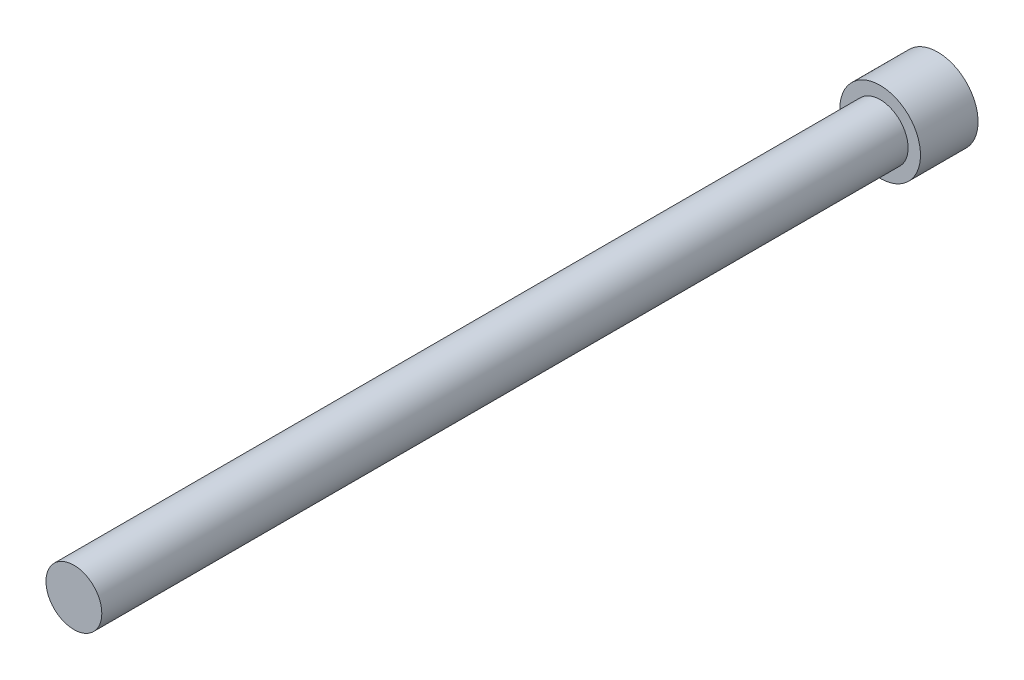
ISO-10303-21;
HEADER;
FILE_DESCRIPTION(('STEP AP214'),'2;1');
FILE_NAME('part.step','',(''),(''),'','','');
FILE_SCHEMA(('AUTOMOTIVE_DESIGN { 1 0 10303 214 1 1 1 1 }'));
ENDSEC;
DATA;
#1=APPLICATION_CONTEXT('core data for automotive mechanical design processes');
#2=APPLICATION_PROTOCOL_DEFINITION('international standard','automotive_design',2000,#1);
#3=PRODUCT_CONTEXT('',#1,'mechanical');
#4=PRODUCT('Part','Part','',(#3));
#5=PRODUCT_RELATED_PRODUCT_CATEGORY('part','',(#4));
#6=PRODUCT_DEFINITION_FORMATION('','',#4);
#7=PRODUCT_DEFINITION_CONTEXT('part definition',#1,'design');
#8=PRODUCT_DEFINITION('design','',#6,#7);
#9=PRODUCT_DEFINITION_SHAPE('','',#8);
#10=(LENGTH_UNIT() NAMED_UNIT(*) SI_UNIT(.MILLI.,.METRE.));
#11=(NAMED_UNIT(*) PLANE_ANGLE_UNIT() SI_UNIT($,.RADIAN.));
#12=(NAMED_UNIT(*) SI_UNIT($,.STERADIAN.) SOLID_ANGLE_UNIT());
#13=UNCERTAINTY_MEASURE_WITH_UNIT(LENGTH_MEASURE(1.E-05),#10,'distance_accuracy_value','');
#14=(GEOMETRIC_REPRESENTATION_CONTEXT(3) GLOBAL_UNCERTAINTY_ASSIGNED_CONTEXT((#13)) GLOBAL_UNIT_ASSIGNED_CONTEXT((#10,
#11,#12)) REPRESENTATION_CONTEXT('',''));
#15=CARTESIAN_POINT('',(0.,0.,0.));
#16=DIRECTION('',(0.,0.,1.));
#17=DIRECTION('',(1.,0.,0.));
#18=AXIS2_PLACEMENT_3D('',#15,#16,#17);
#19=CARTESIAN_POINT('',(0.,0.,70.));
#20=DIRECTION('',(0.,0.,-1.));
#21=DIRECTION('',(-1.,0.,0.));
#22=AXIS2_PLACEMENT_3D('',#19,#20,#21);
#23=CYLINDRICAL_SURFACE('',#22,2.425);
#24=CARTESIAN_POINT('',(0.,0.,70.));
#25=DIRECTION('',(0.,0.,1.));
#26=DIRECTION('',(1.,0.,0.));
#27=AXIS2_PLACEMENT_3D('',#24,#25,#26);
#28=CIRCLE('',#27,2.425);
#29=CARTESIAN_POINT('',(2.425,0.,70.));
#30=VERTEX_POINT('',#29);
#31=EDGE_CURVE('E10',#30,#30,#28,.T.);
#32=ORIENTED_EDGE('',*,*,#31,.F.);
#33=EDGE_LOOP('',(#32));
#34=FACE_BOUND('',#33,.T.);
#35=CARTESIAN_POINT('',(0.,0.,0.));
#36=DIRECTION('',(0.,0.,1.));
#37=DIRECTION('',(1.,0.,0.));
#38=AXIS2_PLACEMENT_3D('',#35,#36,#37);
#39=CIRCLE('',#38,2.425);
#40=CARTESIAN_POINT('',(2.425,0.,0.));
#41=VERTEX_POINT('',#40);
#42=EDGE_CURVE('E44',#41,#41,#39,.T.);
#43=ORIENTED_EDGE('',*,*,#42,.T.);
#44=EDGE_LOOP('',(#43));
#45=FACE_BOUND('',#44,.T.);
#46=ADVANCED_FACE('F41',(#34,#45),#23,.T.);
#47=CARTESIAN_POINT('',(0.,0.,70.));
#48=DIRECTION('',(0.,0.,1.));
#49=DIRECTION('',(1.,0.,0.));
#50=AXIS2_PLACEMENT_3D('',#47,#48,#49);
#51=PLANE('',#50);
#52=ORIENTED_EDGE('',*,*,#31,.T.);
#53=EDGE_LOOP('',(#52));
#54=FACE_BOUND('',#53,.T.);
#55=ADVANCED_FACE('F68',(#54),#51,.T.);
#56=CARTESIAN_POINT('',(0.,0.,-5.));
#57=DIRECTION('',(0.,0.,1.));
#58=DIRECTION('',(1.,0.,0.));
#59=AXIS2_PLACEMENT_3D('',#56,#57,#58);
#60=CYLINDRICAL_SURFACE('',#59,3.5);
#61=CARTESIAN_POINT('',(0.,0.,-5.));
#62=DIRECTION('',(0.,0.,-1.));
#63=DIRECTION('',(-1.,0.,0.));
#64=AXIS2_PLACEMENT_3D('',#61,#62,#63);
#65=CIRCLE('',#64,3.5);
#66=CARTESIAN_POINT('',(-3.5,0.,-5.));
#67=VERTEX_POINT('',#66);
#68=EDGE_CURVE('E53',#67,#67,#65,.T.);
#69=ORIENTED_EDGE('',*,*,#68,.F.);
#70=EDGE_LOOP('',(#69));
#71=FACE_BOUND('',#70,.T.);
#72=CARTESIAN_POINT('',(0.,0.,0.));
#73=DIRECTION('',(0.,0.,-1.));
#74=DIRECTION('',(-1.,0.,0.));
#75=AXIS2_PLACEMENT_3D('',#72,#73,#74);
#76=CIRCLE('',#75,3.5);
#77=CARTESIAN_POINT('',(-3.5,0.,0.));
#78=VERTEX_POINT('',#77);
#79=EDGE_CURVE('E55',#78,#78,#76,.T.);
#80=ORIENTED_EDGE('',*,*,#79,.T.);
#81=EDGE_LOOP('',(#80));
#82=FACE_BOUND('',#81,.T.);
#83=ADVANCED_FACE('F65',(#71,#82),#60,.T.);
#84=CARTESIAN_POINT('',(0.,0.,-5.));
#85=DIRECTION('',(0.,0.,-1.));
#86=DIRECTION('',(-1.,0.,0.));
#87=AXIS2_PLACEMENT_3D('',#84,#85,#86);
#88=PLANE('',#87);
#89=ORIENTED_EDGE('',*,*,#68,.T.);
#90=EDGE_LOOP('',(#89));
#91=FACE_BOUND('',#90,.T.);
#92=ADVANCED_FACE('F63',(#91),#88,.T.);
#93=CARTESIAN_POINT('',(0.,0.,0.));
#94=DIRECTION('',(0.,0.,-1.));
#95=DIRECTION('',(-1.,0.,0.));
#96=AXIS2_PLACEMENT_3D('',#93,#94,#95);
#97=PLANE('',#96);
#98=ORIENTED_EDGE('',*,*,#42,.F.);
#99=EDGE_LOOP('',(#98));
#100=FACE_BOUND('',#99,.T.);
#101=ORIENTED_EDGE('',*,*,#79,.F.);
#102=EDGE_LOOP('',(#101));
#103=FACE_BOUND('',#102,.T.);
#104=ADVANCED_FACE('F72',(#100,#103),#97,.F.);
#105=CLOSED_SHELL('',(#46,#55,#83,#92,#104));
#106=MANIFOLD_SOLID_BREP('B2',#105);
#107=ADVANCED_BREP_SHAPE_REPRESENTATION('',(#18,#106),#14);
#108=SHAPE_DEFINITION_REPRESENTATION(#9,#107);
ENDSEC;
END-ISO-10303-21;
